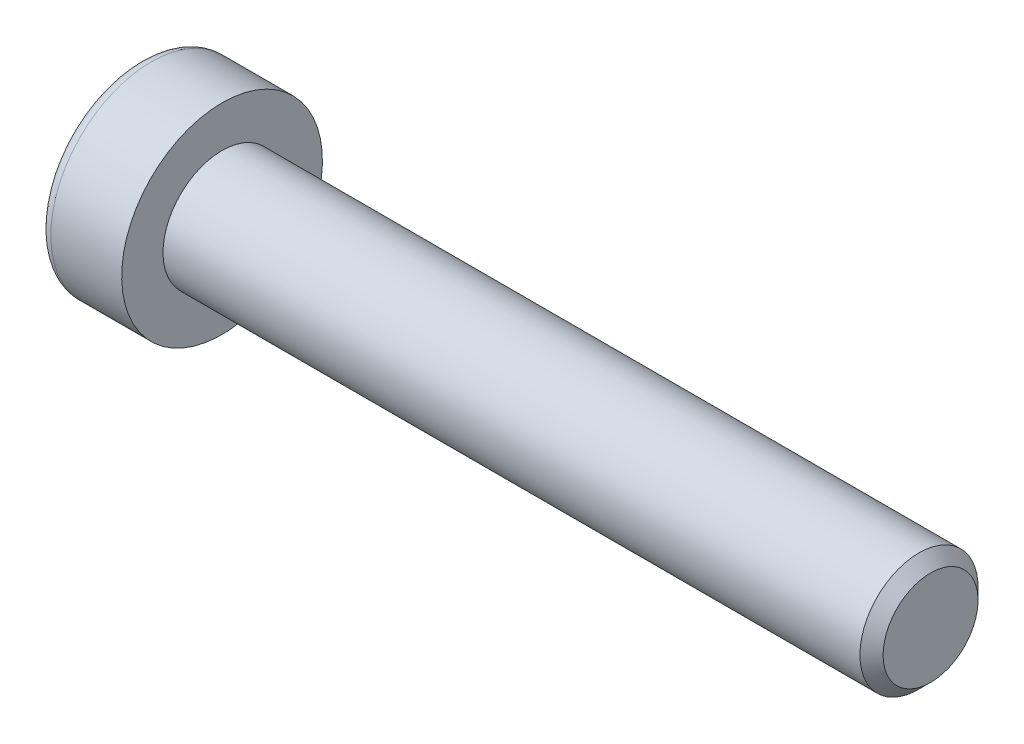
ISO-10303-21;
HEADER;
FILE_DESCRIPTION(('STEP AP214'),'2;1');
FILE_NAME('part.step','',(''),(''),'','','');
FILE_SCHEMA(('AUTOMOTIVE_DESIGN { 1 0 10303 214 1 1 1 1 }'));
ENDSEC;
DATA;
#1=APPLICATION_CONTEXT('core data for automotive mechanical design processes');
#2=APPLICATION_PROTOCOL_DEFINITION('international standard','automotive_design',2000,#1);
#3=PRODUCT_CONTEXT('',#1,'mechanical');
#4=PRODUCT('Part','Part','',(#3));
#5=PRODUCT_RELATED_PRODUCT_CATEGORY('part','',(#4));
#6=PRODUCT_DEFINITION_FORMATION('','',#4);
#7=PRODUCT_DEFINITION_CONTEXT('part definition',#1,'design');
#8=PRODUCT_DEFINITION('design','',#6,#7);
#9=PRODUCT_DEFINITION_SHAPE('','',#8);
#10=(LENGTH_UNIT() NAMED_UNIT(*) SI_UNIT(.MILLI.,.METRE.));
#11=(NAMED_UNIT(*) PLANE_ANGLE_UNIT() SI_UNIT($,.RADIAN.));
#12=(NAMED_UNIT(*) SI_UNIT($,.STERADIAN.) SOLID_ANGLE_UNIT());
#13=UNCERTAINTY_MEASURE_WITH_UNIT(LENGTH_MEASURE(1.E-05),#10,'distance_accuracy_value','');
#14=(GEOMETRIC_REPRESENTATION_CONTEXT(3) GLOBAL_UNCERTAINTY_ASSIGNED_CONTEXT((#13)) GLOBAL_UNIT_ASSIGNED_CONTEXT((#10,
#11,#12)) REPRESENTATION_CONTEXT('',''));
#15=CARTESIAN_POINT('',(0.,0.,0.));
#16=DIRECTION('',(0.,0.,1.));
#17=DIRECTION('',(1.,0.,0.));
#18=AXIS2_PLACEMENT_3D('',#15,#16,#17);
#19=CARTESIAN_POINT('',(-3.5,-1.5,0.866025403784439));
#20=DIRECTION('',(0.,-0.5,0.866025403784439));
#21=DIRECTION('',(0.,-0.866025403784439,-0.5));
#22=AXIS2_PLACEMENT_3D('',#19,#20,#21);
#23=PLANE('',#22);
#24=DIRECTION('',(1.,0.,0.));
#25=VECTOR('',#24,1.);
#26=CARTESIAN_POINT('',(-3.5,-1.5,0.866025403784438));
#27=LINE('',#26,#25);
#28=CARTESIAN_POINT('',(-0.799999988867068,-1.49999996233255,0.866025425531749));
#29=VERTEX_POINT('',#28);
#30=CARTESIAN_POINT('',(-3.5,-1.5,0.866025403784438));
#31=VERTEX_POINT('',#30);
#32=EDGE_CURVE('E78',#29,#31,#27,.F.);
#33=ORIENTED_EDGE('',*,*,#32,.T.);
#34=DIRECTION('',(0.,-0.866025403784439,-0.5));
#35=VECTOR('',#34,1.);
#36=CARTESIAN_POINT('',(-3.5,-1.5,0.866025403784439));
#37=LINE('',#36,#35);
#38=CARTESIAN_POINT('',(-3.5,0.,1.73205080756888));
#39=VERTEX_POINT('',#38);
#40=EDGE_CURVE('E90',#39,#31,#37,.T.);
#41=ORIENTED_EDGE('',*,*,#40,.F.);
#42=DIRECTION('',(1.,0.,0.));
#43=VECTOR('',#42,1.);
#44=CARTESIAN_POINT('',(-3.5,0.,1.73205080756888));
#45=LINE('',#44,#43);
#46=CARTESIAN_POINT('',(-0.799999997521485,1.17041970340917E-08,1.73205080081146));
#47=VERTEX_POINT('',#46);
#48=EDGE_CURVE('E73',#39,#47,#45,.T.);
#49=ORIENTED_EDGE('',*,*,#48,.T.);
#50=CARTESIAN_POINT('',(-0.800000004794053,-1.69571014183717E-08,1.73205077642877));
#51=CARTESIAN_POINT('',(-0.778021656696874,-0.0659159374438855,1.69399421567383));
#52=CARTESIAN_POINT('',(-0.758033503093598,-0.132400840652987,1.65560914452181));
#53=CARTESIAN_POINT('',(-0.723144784654454,-0.266521786306955,1.57817438455973));
#54=CARTESIAN_POINT('',(-0.708256560777632,-0.334160211038563,1.53912332031867));
#55=CARTESIAN_POINT('',(-0.685081966752258,-0.468598851907672,1.46150513374616));
#56=CARTESIAN_POINT('',(-0.67664133885179,-0.535378388716331,1.42294995058342));
#57=CARTESIAN_POINT('',(-0.666566875869104,-0.669251518013702,1.34565826362971));
#58=CARTESIAN_POINT('',(-0.664924696262234,-0.736344624244432,1.30692204058053));
#59=CARTESIAN_POINT('',(-0.668349720014557,-0.861700886716701,1.23454756863114));
#60=CARTESIAN_POINT('',(-0.672575966117477,-0.919982853711116,1.20089845932059));
#61=CARTESIAN_POINT('',(-0.685967975897171,-1.03616709970217,1.13381945363874));
#62=CARTESIAN_POINT('',(-0.695138309776003,-1.09406897714887,1.10038978910236));
#63=CARTESIAN_POINT('',(-0.718062369113586,-1.2104925736284,1.03317259433002));
#64=CARTESIAN_POINT('',(-0.731913222805025,-1.26899956512162,0.999393567043165));
#65=CARTESIAN_POINT('',(-0.763348804941712,-1.38514116892087,0.932339180828007));
#66=CARTESIAN_POINT('',(-0.780926152022884,-1.44277726798599,0.89906296351894));
#67=CARTESIAN_POINT('',(-0.799999976323267,-1.49999992470115,0.866025447258253));
#68=B_SPLINE_CURVE_WITH_KNOTS('',3,(#50,#51,#52,#53,#54,#55,#56,#57,#58,#59,#60,#61,#62,#63,#64,
#65,#66,#67),.UNSPECIFIED.,.F.,.F.,(4,2,2,2,2,2,2,2,4),(0.,0.237762010114539,0.476095365250291,
0.708530707823554,0.940680670783404,1.14278081101932,1.3450680891288,1.55184112920544,
1.75820836138337),.UNSPECIFIED.);
#69=EDGE_CURVE('E19',#47,#29,#68,.T.);
#70=ORIENTED_EDGE('',*,*,#69,.T.);
#71=EDGE_LOOP('',(#33,#41,#49,#70));
#72=FACE_BOUND('',#71,.T.);
#73=ADVANCED_FACE('F15',(#72),#23,.F.);
#74=CARTESIAN_POINT('',(-3.5,-1.5,-0.866025403784438));
#75=DIRECTION('',(0.,-1.,0.));
#76=DIRECTION('',(0.,0.,-1.));
#77=AXIS2_PLACEMENT_3D('',#74,#75,#76);
#78=PLANE('',#77);
#79=DIRECTION('',(1.,0.,0.));
#80=VECTOR('',#79,1.);
#81=CARTESIAN_POINT('',(-3.5,-1.5,-0.866025403784439));
#82=LINE('',#81,#80);
#83=CARTESIAN_POINT('',(-0.799999988871031,-1.5,-0.866025360303542));
#84=VERTEX_POINT('',#83);
#85=CARTESIAN_POINT('',(-3.5,-1.5,-0.866025403784438));
#86=VERTEX_POINT('',#85);
#87=EDGE_CURVE('E217',#84,#86,#82,.F.);
#88=ORIENTED_EDGE('',*,*,#87,.T.);
#89=DIRECTION('',(0.,0.,-1.));
#90=VECTOR('',#89,1.);
#91=CARTESIAN_POINT('',(-3.5,-1.5,-0.866025403784438));
#92=LINE('',#91,#90);
#93=EDGE_CURVE('E89',#31,#86,#92,.T.);
#94=ORIENTED_EDGE('',*,*,#93,.F.);
#95=ORIENTED_EDGE('',*,*,#32,.F.);
#96=CARTESIAN_POINT('',(-0.800000033434989,-1.49999996275919,0.866025430217359));
#97=CARTESIAN_POINT('',(-0.778021676301525,-1.49999998662477,0.789912288030923));
#98=CARTESIAN_POINT('',(-0.758033517947388,-1.49999999641521,0.71314213601303));
#99=CARTESIAN_POINT('',(-0.723144793881313,-1.5000000035934,0.558272606337249));
#100=CARTESIAN_POINT('',(-0.708256569131695,-1.50000000095129,0.480170477841771));
#101=CARTESIAN_POINT('',(-0.68508197255406,-1.49999999907226,0.324934102206935));
#102=CARTESIAN_POINT('',(-0.676641342974203,-1.49999999975269,0.247823733476011));
#103=CARTESIAN_POINT('',(-0.666566877161477,-1.500000000247,0.0932403552687408));
#104=CARTESIAN_POINT('',(-0.664924696406791,-1.50000000006194,0.01576790727506));
#105=CARTESIAN_POINT('',(-0.668349718342616,-1.49999999994608,-0.12898104146176));
#106=CARTESIAN_POINT('',(-0.672575963817816,-1.49999999998547,-0.196279262989629));
#107=CARTESIAN_POINT('',(-0.685967972836551,-1.50000000001455,-0.330437280109427));
#108=CARTESIAN_POINT('',(-0.695138306581063,-1.5000000000042,-0.397296612031607));
#109=CARTESIAN_POINT('',(-0.718062366109409,-1.49999999999571,-0.531731007513679));
#110=CARTESIAN_POINT('',(-0.731913220149705,-1.49999999999786,-0.599289065171955));
#111=CARTESIAN_POINT('',(-0.763348803360585,-1.50000000000214,-0.733397843717908));
#112=CARTESIAN_POINT('',(-0.780926151167941,-1.50000000000427,-0.799950281366898));
#113=CARTESIAN_POINT('',(-0.799999976331814,-1.5,-0.866025316866421));
#114=B_SPLINE_CURVE_WITH_KNOTS('',3,(#96,#97,#98,#99,#100,#101,#102,#103,#104,#105,#106,#107,
#108,#109,#110,#111,#112,#113),.UNSPECIFIED.,.F.,.F.,(4,2,2,2,2,2,2,2,4),(0.,0.237762017439527,
0.476095379639777,0.708530728272866,0.940680697404313,1.14278084610673,1.34506813262744,
1.55184118195675,1.75820842345583),.UNSPECIFIED.);
#115=EDGE_CURVE('E83',#29,#84,#114,.T.);
#116=ORIENTED_EDGE('',*,*,#115,.T.);
#117=EDGE_LOOP('',(#88,#94,#95,#116));
#118=FACE_BOUND('',#117,.T.);
#119=ADVANCED_FACE('F87',(#118),#78,.F.);
#120=CARTESIAN_POINT('',(-3.5,0.,1.73205080756888));
#121=DIRECTION('',(0.,0.500000000000001,0.866025403784438));
#122=DIRECTION('',(0.,-0.866025403784438,0.500000000000001));
#123=AXIS2_PLACEMENT_3D('',#120,#121,#122);
#124=PLANE('',#123);
#125=ORIENTED_EDGE('',*,*,#48,.F.);
#126=DIRECTION('',(0.,-0.866025403784438,0.500000000000001));
#127=VECTOR('',#126,1.);
#128=CARTESIAN_POINT('',(-3.5,0.,1.73205080756888));
#129=LINE('',#128,#127);
#130=CARTESIAN_POINT('',(-3.5,1.5,0.866025403784437));
#131=VERTEX_POINT('',#130);
#132=EDGE_CURVE('E220',#131,#39,#129,.T.);
#133=ORIENTED_EDGE('',*,*,#132,.F.);
#134=DIRECTION('',(1.,0.,0.));
#135=VECTOR('',#134,1.);
#136=CARTESIAN_POINT('',(-3.5,1.5,0.866025403784437));
#137=LINE('',#136,#135);
#138=CARTESIAN_POINT('',(-0.799999988867498,1.5,0.866025360291303));
#139=VERTEX_POINT('',#138);
#140=EDGE_CURVE('E84',#131,#139,#137,.T.);
#141=ORIENTED_EDGE('',*,*,#140,.T.);
#142=CARTESIAN_POINT('',(-0.800000033433567,1.50000000426921,0.8660253583187));
#143=CARTESIAN_POINT('',(-0.778021676295276,1.43408410149037,0.904081950088849));
#144=CARTESIAN_POINT('',(-0.758033517936987,1.36759920446941,0.942467034585691));
#145=CARTESIAN_POINT('',(-0.723144793864638,1.23347826105221,1.01990180566003));
#146=CARTESIAN_POINT('',(-0.708256569113062,1.16583983234576,1.05895286763048));
#147=CARTESIAN_POINT('',(-0.68508197254175,1.03140118651243,1.13657105382219));
#148=CARTESIAN_POINT('',(-0.676641342966919,0.96462164865295,1.1751262387674));
#149=CARTESIAN_POINT('',(-0.666566877160271,0.830748516405722,1.25241792827836));
#150=CARTESIAN_POINT('',(-0.664924696406481,0.763655408276764,1.29115415210369));
#151=CARTESIAN_POINT('',(-0.668349718457172,0.638299137294113,1.36352862876635));
#152=CARTESIAN_POINT('',(-0.67257596442367,0.580017163683088,1.39717774196506));
#153=CARTESIAN_POINT('',(-0.68596797510084,0.463832904503485,1.46425675531158));
#154=CARTESIAN_POINT('',(-0.695138310014093,0.40593102048483,1.49768642362438));
#155=CARTESIAN_POINT('',(-0.718062372456597,0.289507410578443,1.56490362613407));
#156=CARTESIAN_POINT('',(-0.73191322826342,0.231000412237723,1.59868265737804));
#157=CARTESIAN_POINT('',(-0.763348815391527,0.114858794941851,1.66573705139287));
#158=CARTESIAN_POINT('',(-0.780926165347246,0.0572226892272379,1.69901327254471));
#159=CARTESIAN_POINT('',(-0.799999992771162,2.59551646269395E-08,1.73205079258366));
#160=B_SPLINE_CURVE_WITH_KNOTS('',3,(#142,#143,#144,#145,#146,#147,#148,#149,#150,#151,#152,
#153,#154,#155,#156,#157,#158,#159),.UNSPECIFIED.,.F.,.F.,(4,2,2,2,2,2,2,2,4),(0.,
0.237762017496781,0.476095379761698,0.708530728335868,0.94068069740302,1.14278086052986,
1.34506816152837,1.55184122608726,1.75820848269998),.UNSPECIFIED.);
#161=EDGE_CURVE('E120',#139,#47,#160,.T.);
#162=ORIENTED_EDGE('',*,*,#161,.T.);
#163=EDGE_LOOP('',(#125,#133,#141,#162));
#164=FACE_BOUND('',#163,.T.);
#165=ADVANCED_FACE('F113',(#164),#124,.F.);
#166=CARTESIAN_POINT('',(-3.5,0.,-1.73205080756888));
#167=DIRECTION('',(0.,-0.5,-0.866025403784439));
#168=DIRECTION('',(0.,0.866025403784439,-0.5));
#169=AXIS2_PLACEMENT_3D('',#166,#167,#168);
#170=PLANE('',#169);
#171=DIRECTION('',(1.,0.,0.));
#172=VECTOR('',#171,1.);
#173=CARTESIAN_POINT('',(-3.5,0.,-1.73205080756888));
#174=LINE('',#173,#172);
#175=CARTESIAN_POINT('',(-0.799999993625576,-5.19317473651853E-08,-1.73205079406354));
#176=VERTEX_POINT('',#175);
#177=CARTESIAN_POINT('',(-3.5,0.,-1.73205080756888));
#178=VERTEX_POINT('',#177);
#179=EDGE_CURVE('E125',#176,#178,#174,.F.);
#180=ORIENTED_EDGE('',*,*,#179,.T.);
#181=DIRECTION('',(0.,0.866025403784439,-0.5));
#182=VECTOR('',#181,1.);
#183=CARTESIAN_POINT('',(-3.5,0.,-1.73205080756888));
#184=LINE('',#183,#182);
#185=EDGE_CURVE('E38',#86,#178,#184,.T.);
#186=ORIENTED_EDGE('',*,*,#185,.F.);
#187=ORIENTED_EDGE('',*,*,#87,.F.);
#188=CARTESIAN_POINT('',(-0.800000033429313,-1.5000000042963,-0.866025358321739));
#189=CARTESIAN_POINT('',(-0.778021676302421,-1.43408410152741,-0.904081950074176));
#190=CARTESIAN_POINT('',(-0.75803351795084,-1.3675992045205,-0.942467034557997));
#191=CARTESIAN_POINT('',(-0.723144793886204,-1.23347826113726,-1.01990180560912));
#192=CARTESIAN_POINT('',(-0.708256569135469,-1.16583983245078,-1.05895286756938));
#193=CARTESIAN_POINT('',(-0.685081972556364,-1.03140118662151,-1.13657105375968));
#194=CARTESIAN_POINT('',(-0.676641342976148,-0.964621648745721,-1.17512623871396));
#195=CARTESIAN_POINT('',(-0.666566877162353,-0.830748516463139,-1.25241792824509));
#196=CARTESIAN_POINT('',(-0.664924696406954,-0.763655408315126,-1.29115415208152));
#197=CARTESIAN_POINT('',(-0.668349718341486,-0.638299141479767,-1.36352862634979));
#198=CARTESIAN_POINT('',(-0.672575963816185,-0.580017172026168,-1.39717773714819));
#199=CARTESIAN_POINT('',(-0.685967972834059,-0.463832921092294,-1.46425674573402));
#200=CARTESIAN_POINT('',(-0.695138306578215,-0.405931041161778,-1.49768641168654));
#201=CARTESIAN_POINT('',(-0.718062366105987,-0.289507439526365,-1.56490360942098));
#202=CARTESIAN_POINT('',(-0.731913220146064,-0.23100044536442,-1.59868263825233));
#203=CARTESIAN_POINT('',(-0.763348803356627,-0.114858836274076,-1.6657370275297));
#204=CARTESIAN_POINT('',(-0.780926151163884,-0.0572227345867656,-1.69901324635637));
#205=CARTESIAN_POINT('',(-0.799999976327709,-7.52855253307204E-08,-1.73205076410276));
#206=B_SPLINE_CURVE_WITH_KNOTS('',3,(#188,#189,#190,#191,#192,#193,#194,#195,#196,#197,#198,
#199,#200,#201,#202,#203,#204,#205),.UNSPECIFIED.,.F.,.F.,(4,2,2,2,2,2,2,2,4),(0.,
0.237762017437609,0.476095379636302,0.708530728268337,0.940680697398584,1.14278084610309,
1.34506813262598,1.55184118195724,1.75820842345815),.UNSPECIFIED.);
#207=EDGE_CURVE('E96',#84,#176,#206,.T.);
#208=ORIENTED_EDGE('',*,*,#207,.T.);
#209=EDGE_LOOP('',(#180,#186,#187,#208));
#210=FACE_BOUND('',#209,.T.);
#211=ADVANCED_FACE('F116',(#210),#170,.F.);
#212=CARTESIAN_POINT('',(-3.5,1.5,0.866025403784437));
#213=DIRECTION('',(0.,1.,0.));
#214=DIRECTION('',(0.,0.,1.));
#215=AXIS2_PLACEMENT_3D('',#212,#213,#214);
#216=PLANE('',#215);
#217=ORIENTED_EDGE('',*,*,#140,.F.);
#218=DIRECTION('',(0.,0.,1.));
#219=VECTOR('',#218,1.);
#220=CARTESIAN_POINT('',(-3.5,1.5,0.866025403784437));
#221=LINE('',#220,#219);
#222=CARTESIAN_POINT('',(-3.5,1.5,-0.866025403784439));
#223=VERTEX_POINT('',#222);
#224=EDGE_CURVE('E213',#223,#131,#221,.T.);
#225=ORIENTED_EDGE('',*,*,#224,.F.);
#226=DIRECTION('',(1.,0.,0.));
#227=VECTOR('',#226,1.);
#228=CARTESIAN_POINT('',(-3.5,1.5,-0.866025403784439));
#229=LINE('',#228,#227);
#230=CARTESIAN_POINT('',(-0.800000001368559,1.5,-0.866025403596251));
#231=VERTEX_POINT('',#230);
#232=EDGE_CURVE('E204',#223,#231,#229,.T.);
#233=ORIENTED_EDGE('',*,*,#232,.T.);
#234=CARTESIAN_POINT('',(-0.800000001154136,1.50000000026491,-0.866025403454279));
#235=CARTESIAN_POINT('',(-0.778021660048943,1.50000000009515,-0.789912260141364));
#236=CARTESIAN_POINT('',(-0.758033509022436,1.5000000000255,-0.713142109270289));
#237=CARTESIAN_POINT('',(-0.723144791693316,1.49999999997444,-0.558272583727159));
#238=CARTESIAN_POINT('',(-0.708256566349069,1.49999999999323,-0.480170458219125));
#239=CARTESIAN_POINT('',(-0.685081970234259,1.5000000000066,-0.324934087631714));
#240=CARTESIAN_POINT('',(-0.676641341702514,1.50000000000176,-0.247823720966487));
#241=CARTESIAN_POINT('',(-0.666566877089259,1.49999999999824,-0.0932403471747105));
#242=CARTESIAN_POINT('',(-0.664924696478615,1.49999999999956,-0.015767901531159));
#243=CARTESIAN_POINT('',(-0.668349718474959,1.50000000000038,0.128981044687817));
#244=CARTESIAN_POINT('',(-0.672575964042955,1.5000000000001,0.196279266039076));
#245=CARTESIAN_POINT('',(-0.685967973189808,1.4999999999999,0.330437282853159));
#246=CARTESIAN_POINT('',(-0.695138306973846,1.49999999999997,0.397296614645791));
#247=CARTESIAN_POINT('',(-0.71806236652139,1.50000000000003,0.531731009611409));
#248=CARTESIAN_POINT('',(-0.731913220523855,1.50000000000002,0.599289066885838));
#249=CARTESIAN_POINT('',(-0.763348803593243,1.49999999999999,0.733397844592943));
#250=CARTESIAN_POINT('',(-0.780926151292484,1.49999999999997,0.799950281787972));
#251=CARTESIAN_POINT('',(-0.799999976324083,1.5,0.866025316839637));
#252=B_SPLINE_CURVE_WITH_KNOTS('',3,(#234,#235,#236,#237,#238,#239,#240,#241,#242,#243,#244,
#245,#246,#247,#248,#249,#250,#251),.UNSPECIFIED.,.F.,.F.,(4,2,2,2,2,2,2,2,4),(0.,
0.237762008631603,0.476095362696117,0.708530704661828,0.940680666845777,1.14278081501453,
1.34506810117545,1.5518411493544,1.75820838945523),.UNSPECIFIED.);
#253=EDGE_CURVE('E97',#231,#139,#252,.T.);
#254=ORIENTED_EDGE('',*,*,#253,.T.);
#255=EDGE_LOOP('',(#217,#225,#233,#254));
#256=FACE_BOUND('',#255,.T.);
#257=ADVANCED_FACE('F135',(#256),#216,.F.);
#258=CARTESIAN_POINT('',(-0.80600000103459,0.,0.));
#259=DIRECTION('',(-1.,0.,0.));
#260=DIRECTION('',(0.,0.,1.));
#261=AXIS2_PLACEMENT_3D('',#258,#259,#260);
#262=CONICAL_SURFACE('',#261,1.74244311170924,1.04719754984197);
#263=CARTESIAN_POINT('',(0.200000001427725,-1.13686837721616E-10,0.));
#264=VERTEX_POINT('',#263);
#265=VERTEX_LOOP('',#264);
#266=FACE_BOUND('',#265,.T.);
#267=ORIENTED_EDGE('',*,*,#253,.F.);
#268=CARTESIAN_POINT('',(-0.800000001154134,1.49999999984653,-0.866025404178943));
#269=CARTESIAN_POINT('',(-0.778021660038382,1.4340840840587,-0.904081975706894));
#270=CARTESIAN_POINT('',(-0.758033509003093,1.36759918308469,-0.942467051100864));
#271=CARTESIAN_POINT('',(-0.723144791660858,1.23347823959674,-1.01990181386864));
#272=CARTESIAN_POINT('',(-0.708256566312607,1.165839814789,-1.05895287666065));
#273=CARTESIAN_POINT('',(-0.685081970210198,1.03140117427002,-1.1365710619692));
#274=CARTESIAN_POINT('',(-0.676641341688346,0.964621637873208,-1.17512624527867));
#275=CARTESIAN_POINT('',(-0.666566877086974,0.83074850923666,-1.25241793213018));
#276=CARTESIAN_POINT('',(-0.664924696478011,0.763655403255479,-1.29115415493071));
#277=CARTESIAN_POINT('',(-0.668349718704072,0.638299130357656,-1.36352863283382));
#278=CARTESIAN_POINT('',(-0.672575965255319,0.580017152715343,-1.39717774831419));
#279=CARTESIAN_POINT('',(-0.685967977721396,0.463832885526248,-1.46425676625118));
#280=CARTESIAN_POINT('',(-0.695138313844609,0.405930997529957,-1.49768643687251));
#281=CARTESIAN_POINT('',(-0.718062379224753,0.289507379790228,-1.56490364391464));
#282=CARTESIAN_POINT('',(-0.731913236762889,0.23100037759508,-1.59868267738147));
#283=CARTESIAN_POINT('',(-0.763348827672567,0.114858752804272,-1.66573707571853));
#284=CARTESIAN_POINT('',(-0.780926179671749,0.0572226434477013,-1.69901329897057));
#285=CARTESIAN_POINT('',(-0.800000009226824,-2.34118217361701E-08,-1.7320508210857));
#286=B_SPLINE_CURVE_WITH_KNOTS('',3,(#268,#269,#270,#271,#272,#273,#274,#275,#276,#277,#278,
#279,#280,#281,#282,#283,#284,#285),.UNSPECIFIED.,.F.,.F.,(4,2,2,2,2,2,2,2,4),(0.,
0.237762008746921,0.476095362941565,0.708530704789954,0.940680666845832,1.14278084388537,
1.34506815902389,1.55184123768522,1.75820850803633),.UNSPECIFIED.);
#287=EDGE_CURVE('E126',#231,#176,#286,.T.);
#288=ORIENTED_EDGE('',*,*,#287,.T.);
#289=ORIENTED_EDGE('',*,*,#207,.F.);
#290=ORIENTED_EDGE('',*,*,#115,.F.);
#291=ORIENTED_EDGE('',*,*,#69,.F.);
#292=ORIENTED_EDGE('',*,*,#161,.F.);
#293=EDGE_LOOP('',(#267,#288,#289,#290,#291,#292));
#294=FACE_BOUND('',#293,.T.);
#295=ADVANCED_FACE('F94',(#266,#294),#262,.F.);
#296=CARTESIAN_POINT('',(-3.5,1.5,-0.866025403784439));
#297=DIRECTION('',(0.,0.5,-0.866025403784439));
#298=DIRECTION('',(0.,0.866025403784439,0.5));
#299=AXIS2_PLACEMENT_3D('',#296,#297,#298);
#300=PLANE('',#299);
#301=ORIENTED_EDGE('',*,*,#232,.F.);
#302=DIRECTION('',(0.,0.866025403784439,0.5));
#303=VECTOR('',#302,1.);
#304=CARTESIAN_POINT('',(-3.5,0.,-1.73205080756888));
#305=LINE('',#304,#303);
#306=EDGE_CURVE('E215',#178,#223,#305,.T.);
#307=ORIENTED_EDGE('',*,*,#306,.F.);
#308=ORIENTED_EDGE('',*,*,#179,.F.);
#309=ORIENTED_EDGE('',*,*,#287,.F.);
#310=EDGE_LOOP('',(#301,#307,#308,#309));
#311=FACE_BOUND('',#310,.T.);
#312=ADVANCED_FACE('F144',(#311),#300,.F.);
#313=CARTESIAN_POINT('',(-3.5,2.99102540378444,0.));
#314=DIRECTION('',(-1.,0.,0.));
#315=DIRECTION('',(0.,0.,1.));
#316=AXIS2_PLACEMENT_3D('',#313,#314,#315);
#317=PLANE('',#316);
#318=ORIENTED_EDGE('',*,*,#185,.T.);
#319=ORIENTED_EDGE('',*,*,#306,.T.);
#320=ORIENTED_EDGE('',*,*,#224,.T.);
#321=ORIENTED_EDGE('',*,*,#132,.T.);
#322=ORIENTED_EDGE('',*,*,#40,.T.);
#323=ORIENTED_EDGE('',*,*,#93,.T.);
#324=EDGE_LOOP('',(#318,#319,#320,#321,#322,#323));
#325=FACE_BOUND('',#324,.T.);
#326=CARTESIAN_POINT('',(-3.5,0.,0.));
#327=DIRECTION('',(1.,0.,0.));
#328=DIRECTION('',(0.,1.,0.));
#329=AXIS2_PLACEMENT_3D('',#326,#327,#328);
#330=CIRCLE('',#329,3.75);
#331=CARTESIAN_POINT('',(-3.5,3.75,0.));
#332=VERTEX_POINT('',#331);
#333=EDGE_CURVE('E191',#332,#332,#330,.T.);
#334=ORIENTED_EDGE('',*,*,#333,.F.);
#335=EDGE_LOOP('',(#334));
#336=FACE_BOUND('',#335,.T.);
#337=ADVANCED_FACE('F178',(#325,#336),#317,.T.);
#338=CARTESIAN_POINT('',(-3.,0.,0.));
#339=DIRECTION('',(1.,0.,0.));
#340=DIRECTION('',(0.,0.,-1.));
#341=AXIS2_PLACEMENT_3D('',#338,#339,#340);
#342=TOROIDAL_SURFACE('',#341,3.75,0.5);
#343=CARTESIAN_POINT('',(-3.,0.,0.));
#344=DIRECTION('',(1.,0.,0.));
#345=DIRECTION('',(0.,1.,0.));
#346=AXIS2_PLACEMENT_3D('',#343,#344,#345);
#347=CIRCLE('',#346,4.25);
#348=CARTESIAN_POINT('',(-3.,4.25,0.));
#349=VERTEX_POINT('',#348);
#350=EDGE_CURVE('E231',#349,#349,#347,.T.);
#351=ORIENTED_EDGE('',*,*,#350,.F.);
#352=EDGE_LOOP('',(#351));
#353=FACE_BOUND('',#352,.T.);
#354=ORIENTED_EDGE('',*,*,#333,.T.);
#355=EDGE_LOOP('',(#354));
#356=FACE_BOUND('',#355,.T.);
#357=ADVANCED_FACE('F172',(#353,#356),#342,.T.);
#358=CARTESIAN_POINT('',(-1.75,0.,0.));
#359=DIRECTION('',(1.,0.,0.));
#360=DIRECTION('',(0.,1.,0.));
#361=AXIS2_PLACEMENT_3D('',#358,#359,#360);
#362=CYLINDRICAL_SURFACE('',#361,4.25);
#363=ORIENTED_EDGE('',*,*,#350,.T.);
#364=EDGE_LOOP('',(#363));
#365=FACE_BOUND('',#364,.T.);
#366=CARTESIAN_POINT('',(0.,0.,0.));
#367=DIRECTION('',(1.,0.,0.));
#368=DIRECTION('',(0.,1.,0.));
#369=AXIS2_PLACEMENT_3D('',#366,#367,#368);
#370=CIRCLE('',#369,4.25);
#371=CARTESIAN_POINT('',(0.,4.25,0.));
#372=VERTEX_POINT('',#371);
#373=EDGE_CURVE('E229',#372,#372,#370,.T.);
#374=ORIENTED_EDGE('',*,*,#373,.F.);
#375=EDGE_LOOP('',(#374));
#376=FACE_BOUND('',#375,.T.);
#377=ADVANCED_FACE('F168',(#365,#376),#362,.T.);
#378=CARTESIAN_POINT('',(30.,1.25,0.));
#379=DIRECTION('',(1.,0.,0.));
#380=DIRECTION('',(0.,0.,-1.));
#381=AXIS2_PLACEMENT_3D('',#378,#379,#380);
#382=PLANE('',#381);
#383=CARTESIAN_POINT('',(30.0000000002569,0.,0.));
#384=DIRECTION('',(-1.,0.,0.));
#385=DIRECTION('',(0.,0.,1.));
#386=AXIS2_PLACEMENT_3D('',#383,#384,#385);
#387=CIRCLE('',#386,2.00924000017721);
#388=CARTESIAN_POINT('',(30.0000000002569,0.,2.00924000017721));
#389=VERTEX_POINT('',#388);
#390=EDGE_CURVE('E227',#389,#389,#387,.T.);
#391=ORIENTED_EDGE('',*,*,#390,.F.);
#392=EDGE_LOOP('',(#391));
#393=FACE_BOUND('',#392,.T.);
#394=ADVANCED_FACE('F164',(#393),#382,.T.);
#395=CARTESIAN_POINT('',(0.,3.375,0.));
#396=DIRECTION('',(1.,0.,0.));
#397=DIRECTION('',(0.,0.,-1.));
#398=AXIS2_PLACEMENT_3D('',#395,#396,#397);
#399=PLANE('',#398);
#400=CARTESIAN_POINT('',(0.,0.,0.));
#401=DIRECTION('',(1.,0.,0.));
#402=DIRECTION('',(0.,1.,0.));
#403=AXIS2_PLACEMENT_3D('',#400,#401,#402);
#404=CIRCLE('',#403,2.5);
#405=CARTESIAN_POINT('',(0.,2.5,0.));
#406=VERTEX_POINT('',#405);
#407=EDGE_CURVE('E29',#406,#406,#404,.T.);
#408=ORIENTED_EDGE('',*,*,#407,.F.);
#409=EDGE_LOOP('',(#408));
#410=FACE_BOUND('',#409,.T.);
#411=ORIENTED_EDGE('',*,*,#373,.T.);
#412=EDGE_LOOP('',(#411));
#413=FACE_BOUND('',#412,.T.);
#414=ADVANCED_FACE('F157',(#410,#413),#399,.T.);
#415=CARTESIAN_POINT('',(29.5092399998111,0.,0.));
#416=DIRECTION('',(-1.,0.,0.));
#417=DIRECTION('',(0.,0.,1.));
#418=AXIS2_PLACEMENT_3D('',#415,#416,#417);
#419=CONICAL_SURFACE('',#418,2.49999999971351,0.78539816247083);
#420=ORIENTED_EDGE('',*,*,#390,.T.);
#421=EDGE_LOOP('',(#420));
#422=FACE_BOUND('',#421,.T.);
#423=CARTESIAN_POINT('',(29.50924,0.,0.));
#424=DIRECTION('',(1.,0.,0.));
#425=DIRECTION('',(0.,1.,0.));
#426=AXIS2_PLACEMENT_3D('',#423,#424,#425);
#427=CIRCLE('',#426,2.5);
#428=CARTESIAN_POINT('',(29.50924,2.5,0.));
#429=VERTEX_POINT('',#428);
#430=EDGE_CURVE('E10',#429,#429,#427,.F.);
#431=ORIENTED_EDGE('',*,*,#430,.F.);
#432=EDGE_LOOP('',(#431));
#433=FACE_BOUND('',#432,.T.);
#434=ADVANCED_FACE('F150',(#422,#433),#419,.T.);
#435=CARTESIAN_POINT('',(22.,0.,0.));
#436=DIRECTION('',(1.,0.,0.));
#437=DIRECTION('',(0.,1.,0.));
#438=AXIS2_PLACEMENT_3D('',#435,#436,#437);
#439=CYLINDRICAL_SURFACE('',#438,2.5);
#440=ORIENTED_EDGE('',*,*,#430,.T.);
#441=EDGE_LOOP('',(#440));
#442=FACE_BOUND('',#441,.T.);
#443=ORIENTED_EDGE('',*,*,#407,.T.);
#444=EDGE_LOOP('',(#443));
#445=FACE_BOUND('',#444,.T.);
#446=ADVANCED_FACE('F148',(#442,#445),#439,.T.);
#447=CLOSED_SHELL('',(#73,#119,#165,#211,#257,#295,#312,#337,#357,#377,#394,#414,#434,#446));
#448=MANIFOLD_SOLID_BREP('B1',#447);
#449=ADVANCED_BREP_SHAPE_REPRESENTATION('',(#18,#448),#14);
#450=SHAPE_DEFINITION_REPRESENTATION(#9,#449);
ENDSEC;
END-ISO-10303-21;
